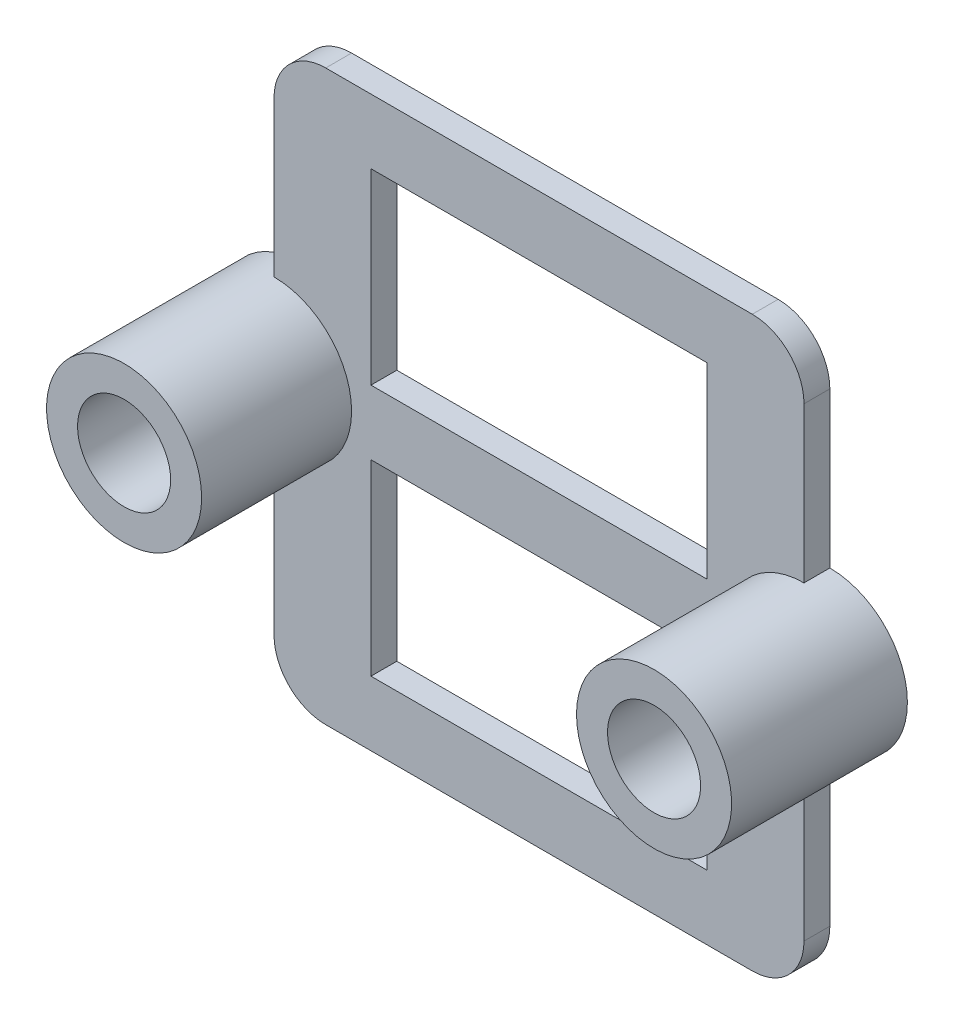
ISO-10303-21;
HEADER;
FILE_DESCRIPTION(('STEP AP214'),'2;1');
FILE_NAME('part.step','',(''),(''),'','','');
FILE_SCHEMA(('AUTOMOTIVE_DESIGN { 1 0 10303 214 1 1 1 1 }'));
ENDSEC;
DATA;
#1=APPLICATION_CONTEXT('core data for automotive mechanical design processes');
#2=APPLICATION_PROTOCOL_DEFINITION('international standard','automotive_design',2000,#1);
#3=PRODUCT_CONTEXT('',#1,'mechanical');
#4=PRODUCT('Part','Part','',(#3));
#5=PRODUCT_RELATED_PRODUCT_CATEGORY('part','',(#4));
#6=PRODUCT_DEFINITION_FORMATION('','',#4);
#7=PRODUCT_DEFINITION_CONTEXT('part definition',#1,'design');
#8=PRODUCT_DEFINITION('design','',#6,#7);
#9=PRODUCT_DEFINITION_SHAPE('','',#8);
#10=(LENGTH_UNIT() NAMED_UNIT(*) SI_UNIT(.MILLI.,.METRE.));
#11=(NAMED_UNIT(*) PLANE_ANGLE_UNIT() SI_UNIT($,.RADIAN.));
#12=(NAMED_UNIT(*) SI_UNIT($,.STERADIAN.) SOLID_ANGLE_UNIT());
#13=UNCERTAINTY_MEASURE_WITH_UNIT(LENGTH_MEASURE(1.E-05),#10,'distance_accuracy_value','');
#14=(GEOMETRIC_REPRESENTATION_CONTEXT(3) GLOBAL_UNCERTAINTY_ASSIGNED_CONTEXT((#13)) GLOBAL_UNIT_ASSIGNED_CONTEXT((#10,
#11,#12)) REPRESENTATION_CONTEXT('',''));
#15=CARTESIAN_POINT('',(0.,0.,0.));
#16=DIRECTION('',(0.,0.,1.));
#17=DIRECTION('',(1.,0.,0.));
#18=AXIS2_PLACEMENT_3D('',#15,#16,#17);
#19=CARTESIAN_POINT('',(10.25,0.,1.));
#20=DIRECTION('',(0.,0.,-1.));
#21=DIRECTION('',(-1.,0.,0.));
#22=AXIS2_PLACEMENT_3D('',#19,#20,#21);
#23=PLANE('',#22);
#24=DIRECTION('',(0.,-1.,0.));
#25=VECTOR('',#24,1.);
#26=CARTESIAN_POINT('',(-6.5,-1.25,1.));
#27=LINE('',#26,#25);
#28=CARTESIAN_POINT('',(-6.5,-1.25,1.));
#29=VERTEX_POINT('',#28);
#30=CARTESIAN_POINT('',(-6.5,-8.5,1.));
#31=VERTEX_POINT('',#30);
#32=EDGE_CURVE('E249',#29,#31,#27,.T.);
#33=ORIENTED_EDGE('',*,*,#32,.F.);
#34=DIRECTION('',(-1.,0.,0.));
#35=VECTOR('',#34,1.);
#36=CARTESIAN_POINT('',(6.5,-1.25,1.));
#37=LINE('',#36,#35);
#38=CARTESIAN_POINT('',(6.5,-1.25,1.));
#39=VERTEX_POINT('',#38);
#40=EDGE_CURVE('E257',#39,#29,#37,.T.);
#41=ORIENTED_EDGE('',*,*,#40,.F.);
#42=DIRECTION('',(0.,1.,0.));
#43=VECTOR('',#42,1.);
#44=CARTESIAN_POINT('',(6.5,-1.25,1.));
#45=LINE('',#44,#43);
#46=CARTESIAN_POINT('',(6.5,-8.5,1.));
#47=VERTEX_POINT('',#46);
#48=EDGE_CURVE('E254',#47,#39,#45,.T.);
#49=ORIENTED_EDGE('',*,*,#48,.F.);
#50=DIRECTION('',(1.,0.,0.));
#51=VECTOR('',#50,1.);
#52=CARTESIAN_POINT('',(6.5,-8.5,1.));
#53=LINE('',#52,#51);
#54=EDGE_CURVE('E251',#31,#47,#53,.T.);
#55=ORIENTED_EDGE('',*,*,#54,.F.);
#56=EDGE_LOOP('',(#33,#41,#49,#55));
#57=FACE_BOUND('',#56,.T.);
#58=DIRECTION('',(0.,-1.,0.));
#59=VECTOR('',#58,1.);
#60=CARTESIAN_POINT('',(-6.5,1.25,1.));
#61=LINE('',#60,#59);
#62=CARTESIAN_POINT('',(-6.5,8.5,1.));
#63=VERTEX_POINT('',#62);
#64=CARTESIAN_POINT('',(-6.5,1.25,1.));
#65=VERTEX_POINT('',#64);
#66=EDGE_CURVE('E218',#63,#65,#61,.T.);
#67=ORIENTED_EDGE('',*,*,#66,.F.);
#68=DIRECTION('',(-1.,0.,0.));
#69=VECTOR('',#68,1.);
#70=CARTESIAN_POINT('',(6.5,8.5,1.));
#71=LINE('',#70,#69);
#72=CARTESIAN_POINT('',(6.5,8.5,1.));
#73=VERTEX_POINT('',#72);
#74=EDGE_CURVE('E226',#73,#63,#71,.T.);
#75=ORIENTED_EDGE('',*,*,#74,.F.);
#76=DIRECTION('',(0.,1.,0.));
#77=VECTOR('',#76,1.);
#78=CARTESIAN_POINT('',(6.5,1.25,1.));
#79=LINE('',#78,#77);
#80=CARTESIAN_POINT('',(6.5,1.25,1.));
#81=VERTEX_POINT('',#80);
#82=EDGE_CURVE('E223',#81,#73,#79,.T.);
#83=ORIENTED_EDGE('',*,*,#82,.F.);
#84=DIRECTION('',(1.,0.,0.));
#85=VECTOR('',#84,1.);
#86=CARTESIAN_POINT('',(-6.5,1.25,1.));
#87=LINE('',#86,#85);
#88=EDGE_CURVE('E220',#65,#81,#87,.T.);
#89=ORIENTED_EDGE('',*,*,#88,.F.);
#90=EDGE_LOOP('',(#67,#75,#83,#89));
#91=FACE_BOUND('',#90,.T.);
#92=DIRECTION('',(1.,0.,0.));
#93=VECTOR('',#92,1.);
#94=CARTESIAN_POINT('',(-10.25,-11.,1.));
#95=LINE('',#94,#93);
#96=CARTESIAN_POINT('',(-8.25,-11.,1.));
#97=VERTEX_POINT('',#96);
#98=CARTESIAN_POINT('',(8.25,-11.,1.));
#99=VERTEX_POINT('',#98);
#100=EDGE_CURVE('E280',#97,#99,#95,.T.);
#101=ORIENTED_EDGE('',*,*,#100,.T.);
#102=CARTESIAN_POINT('',(8.25,-9.,1.));
#103=DIRECTION('',(0.,0.,-1.));
#104=DIRECTION('',(-1.,0.,0.));
#105=AXIS2_PLACEMENT_3D('',#102,#103,#104);
#106=CIRCLE('',#105,2.);
#107=CARTESIAN_POINT('',(10.25,-9.,1.));
#108=VERTEX_POINT('',#107);
#109=EDGE_CURVE('E11',#99,#108,#106,.F.);
#110=ORIENTED_EDGE('',*,*,#109,.T.);
#111=DIRECTION('',(0.,1.,0.));
#112=VECTOR('',#111,1.);
#113=CARTESIAN_POINT('',(10.25,-3.,1.));
#114=LINE('',#113,#112);
#115=CARTESIAN_POINT('',(10.25,-3.,1.));
#116=VERTEX_POINT('',#115);
#117=EDGE_CURVE('E182',#108,#116,#114,.T.);
#118=ORIENTED_EDGE('',*,*,#117,.T.);
#119=CARTESIAN_POINT('',(10.25,0.,1.));
#120=DIRECTION('',(0.,0.,1.));
#121=DIRECTION('',(-1.,0.,0.));
#122=AXIS2_PLACEMENT_3D('',#119,#120,#121);
#123=CIRCLE('',#122,3.);
#124=CARTESIAN_POINT('',(10.25,3.,1.));
#125=VERTEX_POINT('',#124);
#126=EDGE_CURVE('E189',#125,#116,#123,.T.);
#127=ORIENTED_EDGE('',*,*,#126,.F.);
#128=DIRECTION('',(0.,1.,0.));
#129=VECTOR('',#128,1.);
#130=CARTESIAN_POINT('',(10.25,11.,1.));
#131=LINE('',#130,#129);
#132=CARTESIAN_POINT('',(10.25,9.,1.));
#133=VERTEX_POINT('',#132);
#134=EDGE_CURVE('E170',#125,#133,#131,.T.);
#135=ORIENTED_EDGE('',*,*,#134,.T.);
#136=CARTESIAN_POINT('',(8.25,9.,1.));
#137=DIRECTION('',(0.,0.,-1.));
#138=DIRECTION('',(-1.,0.,0.));
#139=AXIS2_PLACEMENT_3D('',#136,#137,#138);
#140=CIRCLE('',#139,2.);
#141=CARTESIAN_POINT('',(8.25,11.,1.));
#142=VERTEX_POINT('',#141);
#143=EDGE_CURVE('E338',#133,#142,#140,.F.);
#144=ORIENTED_EDGE('',*,*,#143,.T.);
#145=DIRECTION('',(-1.,0.,0.));
#146=VECTOR('',#145,1.);
#147=CARTESIAN_POINT('',(6.5,11.,1.));
#148=LINE('',#147,#146);
#149=CARTESIAN_POINT('',(-8.25,11.,1.));
#150=VERTEX_POINT('',#149);
#151=EDGE_CURVE('E181',#142,#150,#148,.T.);
#152=ORIENTED_EDGE('',*,*,#151,.T.);
#153=CARTESIAN_POINT('',(-8.25,9.,1.));
#154=DIRECTION('',(0.,0.,-1.));
#155=DIRECTION('',(-1.,0.,0.));
#156=AXIS2_PLACEMENT_3D('',#153,#154,#155);
#157=CIRCLE('',#156,2.);
#158=CARTESIAN_POINT('',(-10.25,9.,1.));
#159=VERTEX_POINT('',#158);
#160=EDGE_CURVE('E330',#150,#159,#157,.F.);
#161=ORIENTED_EDGE('',*,*,#160,.T.);
#162=DIRECTION('',(0.,-1.,0.));
#163=VECTOR('',#162,1.);
#164=CARTESIAN_POINT('',(-10.25,11.,1.));
#165=LINE('',#164,#163);
#166=CARTESIAN_POINT('',(-10.25,3.,1.));
#167=VERTEX_POINT('',#166);
#168=EDGE_CURVE('E285',#159,#167,#165,.T.);
#169=ORIENTED_EDGE('',*,*,#168,.T.);
#170=CARTESIAN_POINT('',(-10.25,0.,1.));
#171=DIRECTION('',(0.,0.,1.));
#172=DIRECTION('',(1.,0.,0.));
#173=AXIS2_PLACEMENT_3D('',#170,#171,#172);
#174=CIRCLE('',#173,3.);
#175=CARTESIAN_POINT('',(-10.25,-3.,1.));
#176=VERTEX_POINT('',#175);
#177=EDGE_CURVE('E301',#176,#167,#174,.T.);
#178=ORIENTED_EDGE('',*,*,#177,.F.);
#179=DIRECTION('',(0.,-1.,0.));
#180=VECTOR('',#179,1.);
#181=CARTESIAN_POINT('',(-10.25,-3.,1.));
#182=LINE('',#181,#180);
#183=CARTESIAN_POINT('',(-10.25,-9.,1.));
#184=VERTEX_POINT('',#183);
#185=EDGE_CURVE('E314',#176,#184,#182,.T.);
#186=ORIENTED_EDGE('',*,*,#185,.T.);
#187=CARTESIAN_POINT('',(-8.25,-9.,1.));
#188=DIRECTION('',(0.,0.,-1.));
#189=DIRECTION('',(-1.,0.,0.));
#190=AXIS2_PLACEMENT_3D('',#187,#188,#189);
#191=CIRCLE('',#190,2.);
#192=EDGE_CURVE('E347',#184,#97,#191,.F.);
#193=ORIENTED_EDGE('',*,*,#192,.T.);
#194=EDGE_LOOP('',(#101,#110,#118,#127,#135,#144,#152,#161,#169,#178,#186,#193));
#195=FACE_BOUND('',#194,.T.);
#196=ADVANCED_FACE('F33',(#57,#91,#195),#23,.F.);
#197=CARTESIAN_POINT('',(10.25,0.,0.));
#198=DIRECTION('',(0.,0.,-1.));
#199=DIRECTION('',(-1.,0.,0.));
#200=AXIS2_PLACEMENT_3D('',#197,#198,#199);
#201=PLANE('',#200);
#202=CARTESIAN_POINT('',(-10.25,0.,0.));
#203=DIRECTION('',(0.,0.,1.));
#204=DIRECTION('',(-1.,0.,0.));
#205=AXIS2_PLACEMENT_3D('',#202,#203,#204);
#206=CIRCLE('',#205,1.8);
#207=CARTESIAN_POINT('',(-12.05,0.,0.));
#208=VERTEX_POINT('',#207);
#209=EDGE_CURVE('E214',#208,#208,#206,.T.);
#210=ORIENTED_EDGE('',*,*,#209,.T.);
#211=EDGE_LOOP('',(#210));
#212=FACE_BOUND('',#211,.T.);
#213=DIRECTION('',(-1.,0.,0.));
#214=VECTOR('',#213,1.);
#215=CARTESIAN_POINT('',(6.5,-1.25,0.));
#216=LINE('',#215,#214);
#217=CARTESIAN_POINT('',(6.5,-1.25,0.));
#218=VERTEX_POINT('',#217);
#219=CARTESIAN_POINT('',(-6.5,-1.25,0.));
#220=VERTEX_POINT('',#219);
#221=EDGE_CURVE('E252',#218,#220,#216,.T.);
#222=ORIENTED_EDGE('',*,*,#221,.T.);
#223=DIRECTION('',(0.,-1.,0.));
#224=VECTOR('',#223,1.);
#225=CARTESIAN_POINT('',(-6.5,-1.25,0.));
#226=LINE('',#225,#224);
#227=CARTESIAN_POINT('',(-6.5,-8.5,0.));
#228=VERTEX_POINT('',#227);
#229=EDGE_CURVE('E248',#220,#228,#226,.T.);
#230=ORIENTED_EDGE('',*,*,#229,.T.);
#231=DIRECTION('',(1.,0.,0.));
#232=VECTOR('',#231,1.);
#233=CARTESIAN_POINT('',(6.5,-8.5,0.));
#234=LINE('',#233,#232);
#235=CARTESIAN_POINT('',(6.5,-8.5,0.));
#236=VERTEX_POINT('',#235);
#237=EDGE_CURVE('E262',#228,#236,#234,.T.);
#238=ORIENTED_EDGE('',*,*,#237,.T.);
#239=DIRECTION('',(0.,1.,0.));
#240=VECTOR('',#239,1.);
#241=CARTESIAN_POINT('',(6.5,-1.25,0.));
#242=LINE('',#241,#240);
#243=EDGE_CURVE('E265',#236,#218,#242,.T.);
#244=ORIENTED_EDGE('',*,*,#243,.T.);
#245=EDGE_LOOP('',(#222,#230,#238,#244));
#246=FACE_BOUND('',#245,.T.);
#247=DIRECTION('',(0.,1.,0.));
#248=VECTOR('',#247,1.);
#249=CARTESIAN_POINT('',(10.25,-3.,0.));
#250=LINE('',#249,#248);
#251=CARTESIAN_POINT('',(10.25,-9.,0.));
#252=VERTEX_POINT('',#251);
#253=CARTESIAN_POINT('',(10.25,-3.,0.));
#254=VERTEX_POINT('',#253);
#255=EDGE_CURVE('E287',#252,#254,#250,.T.);
#256=ORIENTED_EDGE('',*,*,#255,.F.);
#257=CARTESIAN_POINT('',(8.25,-9.,0.));
#258=DIRECTION('',(0.,0.,-1.));
#259=DIRECTION('',(-1.,0.,0.));
#260=AXIS2_PLACEMENT_3D('',#257,#258,#259);
#261=CIRCLE('',#260,2.);
#262=CARTESIAN_POINT('',(8.25,-11.,0.));
#263=VERTEX_POINT('',#262);
#264=EDGE_CURVE('E55',#252,#263,#261,.T.);
#265=ORIENTED_EDGE('',*,*,#264,.T.);
#266=DIRECTION('',(1.,0.,0.));
#267=VECTOR('',#266,1.);
#268=CARTESIAN_POINT('',(10.25,-11.,0.));
#269=LINE('',#268,#267);
#270=CARTESIAN_POINT('',(-8.25,-11.,0.));
#271=VERTEX_POINT('',#270);
#272=EDGE_CURVE('E279',#271,#263,#269,.T.);
#273=ORIENTED_EDGE('',*,*,#272,.F.);
#274=CARTESIAN_POINT('',(-8.25,-9.,0.));
#275=DIRECTION('',(0.,0.,-1.));
#276=DIRECTION('',(-1.,0.,0.));
#277=AXIS2_PLACEMENT_3D('',#274,#275,#276);
#278=CIRCLE('',#277,2.);
#279=CARTESIAN_POINT('',(-10.25,-9.,0.));
#280=VERTEX_POINT('',#279);
#281=EDGE_CURVE('E343',#271,#280,#278,.T.);
#282=ORIENTED_EDGE('',*,*,#281,.T.);
#283=DIRECTION('',(0.,-1.,0.));
#284=VECTOR('',#283,1.);
#285=CARTESIAN_POINT('',(-10.25,-3.,0.));
#286=LINE('',#285,#284);
#287=CARTESIAN_POINT('',(-10.25,-3.,0.));
#288=VERTEX_POINT('',#287);
#289=EDGE_CURVE('E282',#288,#280,#286,.T.);
#290=ORIENTED_EDGE('',*,*,#289,.F.);
#291=CARTESIAN_POINT('',(-10.25,0.,0.));
#292=DIRECTION('',(0.,0.,1.));
#293=DIRECTION('',(1.,0.,0.));
#294=AXIS2_PLACEMENT_3D('',#291,#292,#293);
#295=CIRCLE('',#294,3.);
#296=CARTESIAN_POINT('',(-10.25,3.,0.));
#297=VERTEX_POINT('',#296);
#298=EDGE_CURVE('E296',#297,#288,#295,.T.);
#299=ORIENTED_EDGE('',*,*,#298,.F.);
#300=DIRECTION('',(0.,-1.,0.));
#301=VECTOR('',#300,1.);
#302=CARTESIAN_POINT('',(-10.25,11.,0.));
#303=LINE('',#302,#301);
#304=CARTESIAN_POINT('',(-10.25,9.,0.));
#305=VERTEX_POINT('',#304);
#306=EDGE_CURVE('E294',#305,#297,#303,.T.);
#307=ORIENTED_EDGE('',*,*,#306,.F.);
#308=CARTESIAN_POINT('',(-8.25,9.,0.));
#309=DIRECTION('',(0.,0.,-1.));
#310=DIRECTION('',(-1.,0.,0.));
#311=AXIS2_PLACEMENT_3D('',#308,#309,#310);
#312=CIRCLE('',#311,2.);
#313=CARTESIAN_POINT('',(-8.25,11.,0.));
#314=VERTEX_POINT('',#313);
#315=EDGE_CURVE('E324',#305,#314,#312,.T.);
#316=ORIENTED_EDGE('',*,*,#315,.T.);
#317=DIRECTION('',(-1.,0.,0.));
#318=VECTOR('',#317,1.);
#319=CARTESIAN_POINT('',(-6.5,11.,0.));
#320=LINE('',#319,#318);
#321=CARTESIAN_POINT('',(8.25,11.,0.));
#322=VERTEX_POINT('',#321);
#323=EDGE_CURVE('E292',#322,#314,#320,.T.);
#324=ORIENTED_EDGE('',*,*,#323,.F.);
#325=CARTESIAN_POINT('',(8.25,9.,0.));
#326=DIRECTION('',(0.,0.,-1.));
#327=DIRECTION('',(-1.,0.,0.));
#328=AXIS2_PLACEMENT_3D('',#325,#326,#327);
#329=CIRCLE('',#328,2.);
#330=CARTESIAN_POINT('',(10.25,9.,0.));
#331=VERTEX_POINT('',#330);
#332=EDGE_CURVE('E335',#322,#331,#329,.T.);
#333=ORIENTED_EDGE('',*,*,#332,.T.);
#334=DIRECTION('',(0.,1.,0.));
#335=VECTOR('',#334,1.);
#336=CARTESIAN_POINT('',(10.25,11.,0.));
#337=LINE('',#336,#335);
#338=CARTESIAN_POINT('',(10.25,3.,0.));
#339=VERTEX_POINT('',#338);
#340=EDGE_CURVE('E290',#339,#331,#337,.T.);
#341=ORIENTED_EDGE('',*,*,#340,.F.);
#342=CARTESIAN_POINT('',(10.25,0.,0.));
#343=DIRECTION('',(0.,0.,1.));
#344=DIRECTION('',(-1.,0.,0.));
#345=AXIS2_PLACEMENT_3D('',#342,#343,#344);
#346=CIRCLE('',#345,3.);
#347=EDGE_CURVE('E191',#254,#339,#346,.T.);
#348=ORIENTED_EDGE('',*,*,#347,.F.);
#349=EDGE_LOOP('',(#256,#265,#273,#282,#290,#299,#307,#316,#324,#333,#341,#348));
#350=FACE_BOUND('',#349,.T.);
#351=DIRECTION('',(-1.,0.,0.));
#352=VECTOR('',#351,1.);
#353=CARTESIAN_POINT('',(6.5,8.5,0.));
#354=LINE('',#353,#352);
#355=CARTESIAN_POINT('',(6.5,8.5,0.));
#356=VERTEX_POINT('',#355);
#357=CARTESIAN_POINT('',(-6.5,8.5,0.));
#358=VERTEX_POINT('',#357);
#359=EDGE_CURVE('E221',#356,#358,#354,.T.);
#360=ORIENTED_EDGE('',*,*,#359,.T.);
#361=DIRECTION('',(0.,-1.,0.));
#362=VECTOR('',#361,1.);
#363=CARTESIAN_POINT('',(-6.5,1.25,0.));
#364=LINE('',#363,#362);
#365=CARTESIAN_POINT('',(-6.5,1.25,0.));
#366=VERTEX_POINT('',#365);
#367=EDGE_CURVE('E217',#358,#366,#364,.T.);
#368=ORIENTED_EDGE('',*,*,#367,.T.);
#369=DIRECTION('',(1.,0.,0.));
#370=VECTOR('',#369,1.);
#371=CARTESIAN_POINT('',(-6.5,1.25,0.));
#372=LINE('',#371,#370);
#373=CARTESIAN_POINT('',(6.5,1.25,0.));
#374=VERTEX_POINT('',#373);
#375=EDGE_CURVE('E231',#366,#374,#372,.T.);
#376=ORIENTED_EDGE('',*,*,#375,.T.);
#377=DIRECTION('',(0.,1.,0.));
#378=VECTOR('',#377,1.);
#379=CARTESIAN_POINT('',(6.5,1.25,0.));
#380=LINE('',#379,#378);
#381=EDGE_CURVE('E234',#374,#356,#380,.T.);
#382=ORIENTED_EDGE('',*,*,#381,.T.);
#383=EDGE_LOOP('',(#360,#368,#376,#382));
#384=FACE_BOUND('',#383,.T.);
#385=CARTESIAN_POINT('',(10.25,0.,0.));
#386=DIRECTION('',(0.,0.,1.));
#387=DIRECTION('',(1.,0.,0.));
#388=AXIS2_PLACEMENT_3D('',#385,#386,#387);
#389=CIRCLE('',#388,1.8);
#390=CARTESIAN_POINT('',(12.05,0.,0.));
#391=VERTEX_POINT('',#390);
#392=EDGE_CURVE('E211',#391,#391,#389,.T.);
#393=ORIENTED_EDGE('',*,*,#392,.T.);
#394=EDGE_LOOP('',(#393));
#395=FACE_BOUND('',#394,.T.);
#396=ADVANCED_FACE('F357',(#212,#246,#350,#384,#395),#201,.T.);
#397=CARTESIAN_POINT('',(10.25,-11.,1.));
#398=DIRECTION('',(0.,1.,0.));
#399=DIRECTION('',(0.,0.,1.));
#400=AXIS2_PLACEMENT_3D('',#397,#398,#399);
#401=PLANE('',#400);
#402=ORIENTED_EDGE('',*,*,#272,.T.);
#403=DIRECTION('',(0.,0.,-1.));
#404=VECTOR('',#403,1.);
#405=CARTESIAN_POINT('',(8.25,-11.,1.));
#406=LINE('',#405,#404);
#407=EDGE_CURVE('E41',#263,#99,#406,.F.);
#408=ORIENTED_EDGE('',*,*,#407,.T.);
#409=ORIENTED_EDGE('',*,*,#100,.F.);
#410=DIRECTION('',(0.,0.,-1.));
#411=VECTOR('',#410,1.);
#412=CARTESIAN_POINT('',(-8.25,-11.,1.));
#413=LINE('',#412,#411);
#414=EDGE_CURVE('E340',#97,#271,#413,.T.);
#415=ORIENTED_EDGE('',*,*,#414,.T.);
#416=EDGE_LOOP('',(#402,#408,#409,#415));
#417=FACE_BOUND('',#416,.T.);
#418=ADVANCED_FACE('F389',(#417),#401,.F.);
#419=CARTESIAN_POINT('',(10.25,-3.,1.));
#420=DIRECTION('',(-1.,0.,0.));
#421=DIRECTION('',(0.,0.,1.));
#422=AXIS2_PLACEMENT_3D('',#419,#420,#421);
#423=PLANE('',#422);
#424=ORIENTED_EDGE('',*,*,#117,.F.);
#425=DIRECTION('',(0.,0.,-1.));
#426=VECTOR('',#425,1.);
#427=CARTESIAN_POINT('',(10.25,-9.,1.));
#428=LINE('',#427,#426);
#429=EDGE_CURVE('E349',#108,#252,#428,.T.);
#430=ORIENTED_EDGE('',*,*,#429,.T.);
#431=ORIENTED_EDGE('',*,*,#255,.T.);
#432=DIRECTION('',(0.,0.,-1.));
#433=VECTOR('',#432,1.);
#434=CARTESIAN_POINT('',(10.25,-3.,1.));
#435=LINE('',#434,#433);
#436=EDGE_CURVE('E192',#116,#254,#435,.T.);
#437=ORIENTED_EDGE('',*,*,#436,.F.);
#438=EDGE_LOOP('',(#424,#430,#431,#437));
#439=FACE_BOUND('',#438,.T.);
#440=ADVANCED_FACE('F354',(#439),#423,.F.);
#441=CARTESIAN_POINT('',(10.25,0.,1.));
#442=DIRECTION('',(0.,0.,-1.));
#443=DIRECTION('',(-1.,0.,0.));
#444=AXIS2_PLACEMENT_3D('',#441,#442,#443);
#445=CYLINDRICAL_SURFACE('',#444,3.);
#446=ORIENTED_EDGE('',*,*,#347,.T.);
#447=DIRECTION('',(0.,0.,-1.));
#448=VECTOR('',#447,1.);
#449=CARTESIAN_POINT('',(10.25,3.,1.));
#450=LINE('',#449,#448);
#451=EDGE_CURVE('E174',#125,#339,#450,.T.);
#452=ORIENTED_EDGE('',*,*,#451,.F.);
#453=ORIENTED_EDGE('',*,*,#126,.T.);
#454=ORIENTED_EDGE('',*,*,#436,.T.);
#455=EDGE_LOOP('',(#446,#452,#453,#454));
#456=FACE_BOUND('',#455,.T.);
#457=CARTESIAN_POINT('',(10.25,0.,6.8));
#458=DIRECTION('',(0.,0.,1.));
#459=DIRECTION('',(-1.,0.,0.));
#460=AXIS2_PLACEMENT_3D('',#457,#458,#459);
#461=CIRCLE('',#460,3.);
#462=CARTESIAN_POINT('',(7.25,0.,6.8));
#463=VERTEX_POINT('',#462);
#464=EDGE_CURVE('E197',#463,#463,#461,.T.);
#465=ORIENTED_EDGE('',*,*,#464,.F.);
#466=EDGE_LOOP('',(#465));
#467=FACE_BOUND('',#466,.T.);
#468=ADVANCED_FACE('F186',(#456,#467),#445,.T.);
#469=CARTESIAN_POINT('',(10.25,11.,1.));
#470=DIRECTION('',(-1.,0.,0.));
#471=DIRECTION('',(0.,0.,1.));
#472=AXIS2_PLACEMENT_3D('',#469,#470,#471);
#473=PLANE('',#472);
#474=ORIENTED_EDGE('',*,*,#340,.T.);
#475=DIRECTION('',(0.,0.,-1.));
#476=VECTOR('',#475,1.);
#477=CARTESIAN_POINT('',(10.25,9.,1.));
#478=LINE('',#477,#476);
#479=EDGE_CURVE('E177',#331,#133,#478,.F.);
#480=ORIENTED_EDGE('',*,*,#479,.T.);
#481=ORIENTED_EDGE('',*,*,#134,.F.);
#482=ORIENTED_EDGE('',*,*,#451,.T.);
#483=EDGE_LOOP('',(#474,#480,#481,#482));
#484=FACE_BOUND('',#483,.T.);
#485=ADVANCED_FACE('F173',(#484),#473,.F.);
#486=CARTESIAN_POINT('',(-6.5,11.,1.));
#487=DIRECTION('',(0.,-1.,0.));
#488=DIRECTION('',(0.,0.,-1.));
#489=AXIS2_PLACEMENT_3D('',#486,#487,#488);
#490=PLANE('',#489);
#491=ORIENTED_EDGE('',*,*,#151,.F.);
#492=DIRECTION('',(0.,0.,-1.));
#493=VECTOR('',#492,1.);
#494=CARTESIAN_POINT('',(8.25,11.,1.));
#495=LINE('',#494,#493);
#496=EDGE_CURVE('E332',#142,#322,#495,.T.);
#497=ORIENTED_EDGE('',*,*,#496,.T.);
#498=ORIENTED_EDGE('',*,*,#323,.T.);
#499=DIRECTION('',(0.,0.,-1.));
#500=VECTOR('',#499,1.);
#501=CARTESIAN_POINT('',(-8.25,11.,1.));
#502=LINE('',#501,#500);
#503=EDGE_CURVE('E327',#314,#150,#502,.F.);
#504=ORIENTED_EDGE('',*,*,#503,.T.);
#505=EDGE_LOOP('',(#491,#497,#498,#504));
#506=FACE_BOUND('',#505,.T.);
#507=ADVANCED_FACE('F365',(#506),#490,.F.);
#508=CARTESIAN_POINT('',(-10.25,11.,1.));
#509=DIRECTION('',(1.,0.,0.));
#510=DIRECTION('',(0.,0.,-1.));
#511=AXIS2_PLACEMENT_3D('',#508,#509,#510);
#512=PLANE('',#511);
#513=ORIENTED_EDGE('',*,*,#168,.F.);
#514=DIRECTION('',(0.,0.,-1.));
#515=VECTOR('',#514,1.);
#516=CARTESIAN_POINT('',(-10.25,9.,1.));
#517=LINE('',#516,#515);
#518=EDGE_CURVE('E309',#159,#305,#517,.T.);
#519=ORIENTED_EDGE('',*,*,#518,.T.);
#520=ORIENTED_EDGE('',*,*,#306,.T.);
#521=DIRECTION('',(0.,0.,-1.));
#522=VECTOR('',#521,1.);
#523=CARTESIAN_POINT('',(-10.25,3.,1.));
#524=LINE('',#523,#522);
#525=EDGE_CURVE('E193',#167,#297,#524,.T.);
#526=ORIENTED_EDGE('',*,*,#525,.F.);
#527=EDGE_LOOP('',(#513,#519,#520,#526));
#528=FACE_BOUND('',#527,.T.);
#529=ADVANCED_FACE('F374',(#528),#512,.F.);
#530=CARTESIAN_POINT('',(-10.25,0.,1.));
#531=DIRECTION('',(0.,0.,-1.));
#532=DIRECTION('',(-1.,0.,0.));
#533=AXIS2_PLACEMENT_3D('',#530,#531,#532);
#534=CYLINDRICAL_SURFACE('',#533,3.);
#535=ORIENTED_EDGE('',*,*,#298,.T.);
#536=DIRECTION('',(0.,0.,-1.));
#537=VECTOR('',#536,1.);
#538=CARTESIAN_POINT('',(-10.25,-3.,1.));
#539=LINE('',#538,#537);
#540=EDGE_CURVE('E311',#176,#288,#539,.T.);
#541=ORIENTED_EDGE('',*,*,#540,.F.);
#542=ORIENTED_EDGE('',*,*,#177,.T.);
#543=ORIENTED_EDGE('',*,*,#525,.T.);
#544=EDGE_LOOP('',(#535,#541,#542,#543));
#545=FACE_BOUND('',#544,.T.);
#546=CARTESIAN_POINT('',(-10.25,0.,6.8));
#547=DIRECTION('',(0.,0.,1.));
#548=DIRECTION('',(1.,0.,0.));
#549=AXIS2_PLACEMENT_3D('',#546,#547,#548);
#550=CIRCLE('',#549,3.);
#551=CARTESIAN_POINT('',(-7.25,0.,6.8));
#552=VERTEX_POINT('',#551);
#553=EDGE_CURVE('E208',#552,#552,#550,.T.);
#554=ORIENTED_EDGE('',*,*,#553,.F.);
#555=EDGE_LOOP('',(#554));
#556=FACE_BOUND('',#555,.T.);
#557=ADVANCED_FACE('F380',(#545,#556),#534,.T.);
#558=CARTESIAN_POINT('',(-10.25,-3.,1.));
#559=DIRECTION('',(1.,0.,0.));
#560=DIRECTION('',(0.,0.,-1.));
#561=AXIS2_PLACEMENT_3D('',#558,#559,#560);
#562=PLANE('',#561);
#563=ORIENTED_EDGE('',*,*,#289,.T.);
#564=DIRECTION('',(0.,0.,-1.));
#565=VECTOR('',#564,1.);
#566=CARTESIAN_POINT('',(-10.25,-9.,1.));
#567=LINE('',#566,#565);
#568=EDGE_CURVE('E345',#280,#184,#567,.F.);
#569=ORIENTED_EDGE('',*,*,#568,.T.);
#570=ORIENTED_EDGE('',*,*,#185,.F.);
#571=ORIENTED_EDGE('',*,*,#540,.T.);
#572=EDGE_LOOP('',(#563,#569,#570,#571));
#573=FACE_BOUND('',#572,.T.);
#574=ADVANCED_FACE('F391',(#573),#562,.F.);
#575=CARTESIAN_POINT('',(-6.5,-1.25,1.));
#576=DIRECTION('',(1.,0.,0.));
#577=DIRECTION('',(0.,1.,0.));
#578=AXIS2_PLACEMENT_3D('',#575,#576,#577);
#579=PLANE('',#578);
#580=ORIENTED_EDGE('',*,*,#229,.F.);
#581=DIRECTION('',(0.,0.,-1.));
#582=VECTOR('',#581,1.);
#583=CARTESIAN_POINT('',(-6.5,-1.25,1.));
#584=LINE('',#583,#582);
#585=EDGE_CURVE('E259',#29,#220,#584,.T.);
#586=ORIENTED_EDGE('',*,*,#585,.F.);
#587=ORIENTED_EDGE('',*,*,#32,.T.);
#588=DIRECTION('',(0.,0.,-1.));
#589=VECTOR('',#588,1.);
#590=CARTESIAN_POINT('',(-6.5,-8.5,1.));
#591=LINE('',#590,#589);
#592=EDGE_CURVE('E276',#31,#228,#591,.T.);
#593=ORIENTED_EDGE('',*,*,#592,.T.);
#594=EDGE_LOOP('',(#580,#586,#587,#593));
#595=FACE_BOUND('',#594,.T.);
#596=ADVANCED_FACE('F393',(#595),#579,.T.);
#597=CARTESIAN_POINT('',(6.5,-8.5,1.));
#598=DIRECTION('',(0.,1.,0.));
#599=DIRECTION('',(0.,0.,1.));
#600=AXIS2_PLACEMENT_3D('',#597,#598,#599);
#601=PLANE('',#600);
#602=ORIENTED_EDGE('',*,*,#237,.F.);
#603=ORIENTED_EDGE('',*,*,#592,.F.);
#604=ORIENTED_EDGE('',*,*,#54,.T.);
#605=DIRECTION('',(0.,0.,-1.));
#606=VECTOR('',#605,1.);
#607=CARTESIAN_POINT('',(6.5,-8.5,1.));
#608=LINE('',#607,#606);
#609=EDGE_CURVE('E274',#47,#236,#608,.T.);
#610=ORIENTED_EDGE('',*,*,#609,.T.);
#611=EDGE_LOOP('',(#602,#603,#604,#610));
#612=FACE_BOUND('',#611,.T.);
#613=ADVANCED_FACE('F399',(#612),#601,.T.);
#614=CARTESIAN_POINT('',(6.5,-1.25,1.));
#615=DIRECTION('',(-1.,0.,0.));
#616=DIRECTION('',(0.,-1.,0.));
#617=AXIS2_PLACEMENT_3D('',#614,#615,#616);
#618=PLANE('',#617);
#619=ORIENTED_EDGE('',*,*,#243,.F.);
#620=ORIENTED_EDGE('',*,*,#609,.F.);
#621=ORIENTED_EDGE('',*,*,#48,.T.);
#622=DIRECTION('',(0.,0.,-1.));
#623=VECTOR('',#622,1.);
#624=CARTESIAN_POINT('',(6.5,-1.25,1.));
#625=LINE('',#624,#623);
#626=EDGE_CURVE('E272',#39,#218,#625,.T.);
#627=ORIENTED_EDGE('',*,*,#626,.T.);
#628=EDGE_LOOP('',(#619,#620,#621,#627));
#629=FACE_BOUND('',#628,.T.);
#630=ADVANCED_FACE('F416',(#629),#618,.T.);
#631=CARTESIAN_POINT('',(6.5,-1.25,1.));
#632=DIRECTION('',(0.,-1.,0.));
#633=DIRECTION('',(0.,0.,-1.));
#634=AXIS2_PLACEMENT_3D('',#631,#632,#633);
#635=PLANE('',#634);
#636=ORIENTED_EDGE('',*,*,#221,.F.);
#637=ORIENTED_EDGE('',*,*,#626,.F.);
#638=ORIENTED_EDGE('',*,*,#40,.T.);
#639=ORIENTED_EDGE('',*,*,#585,.T.);
#640=EDGE_LOOP('',(#636,#637,#638,#639));
#641=FACE_BOUND('',#640,.T.);
#642=ADVANCED_FACE('F420',(#641),#635,.T.);
#643=CARTESIAN_POINT('',(-6.5,1.25,1.));
#644=DIRECTION('',(1.,0.,0.));
#645=DIRECTION('',(0.,0.,-1.));
#646=AXIS2_PLACEMENT_3D('',#643,#644,#645);
#647=PLANE('',#646);
#648=ORIENTED_EDGE('',*,*,#367,.F.);
#649=DIRECTION('',(0.,0.,-1.));
#650=VECTOR('',#649,1.);
#651=CARTESIAN_POINT('',(-6.5,8.5,1.));
#652=LINE('',#651,#650);
#653=EDGE_CURVE('E228',#63,#358,#652,.T.);
#654=ORIENTED_EDGE('',*,*,#653,.F.);
#655=ORIENTED_EDGE('',*,*,#66,.T.);
#656=DIRECTION('',(0.,0.,-1.));
#657=VECTOR('',#656,1.);
#658=CARTESIAN_POINT('',(-6.5,1.25,1.));
#659=LINE('',#658,#657);
#660=EDGE_CURVE('E245',#65,#366,#659,.T.);
#661=ORIENTED_EDGE('',*,*,#660,.T.);
#662=EDGE_LOOP('',(#648,#654,#655,#661));
#663=FACE_BOUND('',#662,.T.);
#664=ADVANCED_FACE('F424',(#663),#647,.T.);
#665=CARTESIAN_POINT('',(-6.5,1.25,1.));
#666=DIRECTION('',(0.,1.,0.));
#667=DIRECTION('',(0.,0.,1.));
#668=AXIS2_PLACEMENT_3D('',#665,#666,#667);
#669=PLANE('',#668);
#670=ORIENTED_EDGE('',*,*,#375,.F.);
#671=ORIENTED_EDGE('',*,*,#660,.F.);
#672=ORIENTED_EDGE('',*,*,#88,.T.);
#673=DIRECTION('',(0.,0.,-1.));
#674=VECTOR('',#673,1.);
#675=CARTESIAN_POINT('',(6.5,1.25,1.));
#676=LINE('',#675,#674);
#677=EDGE_CURVE('E243',#81,#374,#676,.T.);
#678=ORIENTED_EDGE('',*,*,#677,.T.);
#679=EDGE_LOOP('',(#670,#671,#672,#678));
#680=FACE_BOUND('',#679,.T.);
#681=ADVANCED_FACE('F428',(#680),#669,.T.);
#682=CARTESIAN_POINT('',(6.5,1.25,1.));
#683=DIRECTION('',(-1.,0.,0.));
#684=DIRECTION('',(0.,0.,1.));
#685=AXIS2_PLACEMENT_3D('',#682,#683,#684);
#686=PLANE('',#685);
#687=ORIENTED_EDGE('',*,*,#381,.F.);
#688=ORIENTED_EDGE('',*,*,#677,.F.);
#689=ORIENTED_EDGE('',*,*,#82,.T.);
#690=DIRECTION('',(0.,0.,-1.));
#691=VECTOR('',#690,1.);
#692=CARTESIAN_POINT('',(6.5,8.5,1.));
#693=LINE('',#692,#691);
#694=EDGE_CURVE('E241',#73,#356,#693,.T.);
#695=ORIENTED_EDGE('',*,*,#694,.T.);
#696=EDGE_LOOP('',(#687,#688,#689,#695));
#697=FACE_BOUND('',#696,.T.);
#698=ADVANCED_FACE('F432',(#697),#686,.T.);
#699=CARTESIAN_POINT('',(6.5,8.5,1.));
#700=DIRECTION('',(0.,-1.,0.));
#701=DIRECTION('',(0.,0.,-1.));
#702=AXIS2_PLACEMENT_3D('',#699,#700,#701);
#703=PLANE('',#702);
#704=ORIENTED_EDGE('',*,*,#359,.F.);
#705=ORIENTED_EDGE('',*,*,#694,.F.);
#706=ORIENTED_EDGE('',*,*,#74,.T.);
#707=ORIENTED_EDGE('',*,*,#653,.T.);
#708=EDGE_LOOP('',(#704,#705,#706,#707));
#709=FACE_BOUND('',#708,.T.);
#710=ADVANCED_FACE('F436',(#709),#703,.T.);
#711=CARTESIAN_POINT('',(-10.25,0.,1.));
#712=DIRECTION('',(0.,0.,-1.));
#713=DIRECTION('',(-1.,0.,0.));
#714=AXIS2_PLACEMENT_3D('',#711,#712,#713);
#715=CYLINDRICAL_SURFACE('',#714,1.8);
#716=ORIENTED_EDGE('',*,*,#209,.F.);
#717=EDGE_LOOP('',(#716));
#718=FACE_BOUND('',#717,.T.);
#719=CARTESIAN_POINT('',(-10.25,0.,6.8));
#720=DIRECTION('',(0.,0.,1.));
#721=DIRECTION('',(1.,0.,0.));
#722=AXIS2_PLACEMENT_3D('',#719,#720,#721);
#723=CIRCLE('',#722,1.8);
#724=CARTESIAN_POINT('',(-8.45,0.,6.8));
#725=VERTEX_POINT('',#724);
#726=EDGE_CURVE('E201',#725,#725,#723,.T.);
#727=ORIENTED_EDGE('',*,*,#726,.T.);
#728=EDGE_LOOP('',(#727));
#729=FACE_BOUND('',#728,.T.);
#730=ADVANCED_FACE('F440',(#718,#729),#715,.F.);
#731=CARTESIAN_POINT('',(10.25,0.,1.));
#732=DIRECTION('',(0.,0.,-1.));
#733=DIRECTION('',(-1.,0.,0.));
#734=AXIS2_PLACEMENT_3D('',#731,#732,#733);
#735=CYLINDRICAL_SURFACE('',#734,1.8);
#736=ORIENTED_EDGE('',*,*,#392,.F.);
#737=EDGE_LOOP('',(#736));
#738=FACE_BOUND('',#737,.T.);
#739=CARTESIAN_POINT('',(10.25,0.,6.8));
#740=DIRECTION('',(0.,0.,1.));
#741=DIRECTION('',(-1.,0.,0.));
#742=AXIS2_PLACEMENT_3D('',#739,#740,#741);
#743=CIRCLE('',#742,1.8);
#744=CARTESIAN_POINT('',(8.45,0.,6.8));
#745=VERTEX_POINT('',#744);
#746=EDGE_CURVE('E198',#745,#745,#743,.T.);
#747=ORIENTED_EDGE('',*,*,#746,.T.);
#748=EDGE_LOOP('',(#747));
#749=FACE_BOUND('',#748,.T.);
#750=ADVANCED_FACE('F444',(#738,#749),#735,.F.);
#751=CARTESIAN_POINT('',(-10.25,0.,6.8));
#752=DIRECTION('',(0.,0.,1.));
#753=DIRECTION('',(1.,0.,0.));
#754=AXIS2_PLACEMENT_3D('',#751,#752,#753);
#755=PLANE('',#754);
#756=ORIENTED_EDGE('',*,*,#553,.T.);
#757=EDGE_LOOP('',(#756));
#758=FACE_BOUND('',#757,.T.);
#759=ORIENTED_EDGE('',*,*,#726,.F.);
#760=EDGE_LOOP('',(#759));
#761=FACE_BOUND('',#760,.T.);
#762=ADVANCED_FACE('F448',(#758,#761),#755,.T.);
#763=CARTESIAN_POINT('',(10.25,0.,6.8));
#764=DIRECTION('',(0.,0.,-1.));
#765=DIRECTION('',(-1.,0.,0.));
#766=AXIS2_PLACEMENT_3D('',#763,#764,#765);
#767=PLANE('',#766);
#768=ORIENTED_EDGE('',*,*,#464,.T.);
#769=EDGE_LOOP('',(#768));
#770=FACE_BOUND('',#769,.T.);
#771=ORIENTED_EDGE('',*,*,#746,.F.);
#772=EDGE_LOOP('',(#771));
#773=FACE_BOUND('',#772,.T.);
#774=ADVANCED_FACE('F452',(#770,#773),#767,.F.);
#775=CARTESIAN_POINT('',(-8.25,9.,1.));
#776=DIRECTION('',(0.,0.,-1.));
#777=DIRECTION('',(-1.,0.,0.));
#778=AXIS2_PLACEMENT_3D('',#775,#776,#777);
#779=CYLINDRICAL_SURFACE('',#778,2.);
#780=ORIENTED_EDGE('',*,*,#160,.F.);
#781=ORIENTED_EDGE('',*,*,#503,.F.);
#782=ORIENTED_EDGE('',*,*,#315,.F.);
#783=ORIENTED_EDGE('',*,*,#518,.F.);
#784=EDGE_LOOP('',(#780,#781,#782,#783));
#785=FACE_BOUND('',#784,.T.);
#786=ADVANCED_FACE('F370',(#785),#779,.T.);
#787=CARTESIAN_POINT('',(8.25,9.,1.));
#788=DIRECTION('',(0.,0.,-1.));
#789=DIRECTION('',(-1.,0.,0.));
#790=AXIS2_PLACEMENT_3D('',#787,#788,#789);
#791=CYLINDRICAL_SURFACE('',#790,2.);
#792=ORIENTED_EDGE('',*,*,#143,.F.);
#793=ORIENTED_EDGE('',*,*,#479,.F.);
#794=ORIENTED_EDGE('',*,*,#332,.F.);
#795=ORIENTED_EDGE('',*,*,#496,.F.);
#796=EDGE_LOOP('',(#792,#793,#794,#795));
#797=FACE_BOUND('',#796,.T.);
#798=ADVANCED_FACE('F361',(#797),#791,.T.);
#799=CARTESIAN_POINT('',(-8.25,-9.,1.));
#800=DIRECTION('',(0.,0.,-1.));
#801=DIRECTION('',(-1.,0.,0.));
#802=AXIS2_PLACEMENT_3D('',#799,#800,#801);
#803=CYLINDRICAL_SURFACE('',#802,2.);
#804=ORIENTED_EDGE('',*,*,#192,.F.);
#805=ORIENTED_EDGE('',*,*,#568,.F.);
#806=ORIENTED_EDGE('',*,*,#281,.F.);
#807=ORIENTED_EDGE('',*,*,#414,.F.);
#808=EDGE_LOOP('',(#804,#805,#806,#807));
#809=FACE_BOUND('',#808,.T.);
#810=ADVANCED_FACE('F388',(#809),#803,.T.);
#811=CARTESIAN_POINT('',(8.25,-9.,1.));
#812=DIRECTION('',(0.,0.,-1.));
#813=DIRECTION('',(-1.,0.,0.));
#814=AXIS2_PLACEMENT_3D('',#811,#812,#813);
#815=CYLINDRICAL_SURFACE('',#814,2.);
#816=ORIENTED_EDGE('',*,*,#109,.F.);
#817=ORIENTED_EDGE('',*,*,#407,.F.);
#818=ORIENTED_EDGE('',*,*,#264,.F.);
#819=ORIENTED_EDGE('',*,*,#429,.F.);
#820=EDGE_LOOP('',(#816,#817,#818,#819));
#821=FACE_BOUND('',#820,.T.);
#822=ADVANCED_FACE('F35',(#821),#815,.T.);
#823=CLOSED_SHELL('',(#196,#396,#418,#440,#468,#485,#507,#529,#557,#574,#596,#613,#630,#642,
#664,#681,#698,#710,#730,#750,#762,#774,#786,#798,#810,#822));
#824=MANIFOLD_SOLID_BREP('B2',#823);
#825=ADVANCED_BREP_SHAPE_REPRESENTATION('',(#18,#824),#14);
#826=SHAPE_DEFINITION_REPRESENTATION(#9,#825);
ENDSEC;
END-ISO-10303-21;
